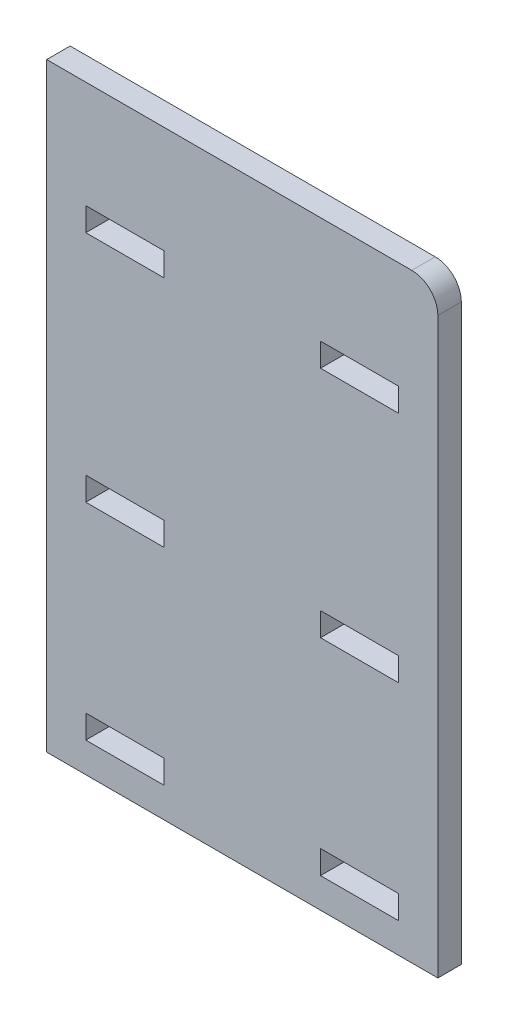
ISO-10303-21;
HEADER;
FILE_DESCRIPTION(('STEP AP214'),'2;1');
FILE_NAME('part.step','',(''),(''),'','','');
FILE_SCHEMA(('AUTOMOTIVE_DESIGN { 1 0 10303 214 1 1 1 1 }'));
ENDSEC;
DATA;
#1=APPLICATION_CONTEXT('core data for automotive mechanical design processes');
#2=APPLICATION_PROTOCOL_DEFINITION('international standard','automotive_design',2000,#1);
#3=PRODUCT_CONTEXT('',#1,'mechanical');
#4=PRODUCT('Part','Part','',(#3));
#5=PRODUCT_RELATED_PRODUCT_CATEGORY('part','',(#4));
#6=PRODUCT_DEFINITION_FORMATION('','',#4);
#7=PRODUCT_DEFINITION_CONTEXT('part definition',#1,'design');
#8=PRODUCT_DEFINITION('design','',#6,#7);
#9=PRODUCT_DEFINITION_SHAPE('','',#8);
#10=(LENGTH_UNIT() NAMED_UNIT(*) SI_UNIT(.MILLI.,.METRE.));
#11=(NAMED_UNIT(*) PLANE_ANGLE_UNIT() SI_UNIT($,.RADIAN.));
#12=(NAMED_UNIT(*) SI_UNIT($,.STERADIAN.) SOLID_ANGLE_UNIT());
#13=UNCERTAINTY_MEASURE_WITH_UNIT(LENGTH_MEASURE(1.E-05),#10,'distance_accuracy_value','');
#14=(GEOMETRIC_REPRESENTATION_CONTEXT(3) GLOBAL_UNCERTAINTY_ASSIGNED_CONTEXT((#13)) GLOBAL_UNIT_ASSIGNED_CONTEXT((#10,
#11,#12)) REPRESENTATION_CONTEXT('',''));
#15=CARTESIAN_POINT('',(0.,0.,0.));
#16=DIRECTION('',(0.,0.,1.));
#17=DIRECTION('',(1.,0.,0.));
#18=AXIS2_PLACEMENT_3D('',#15,#16,#17);
#19=CARTESIAN_POINT('',(0.,-47.25,4.5));
#20=DIRECTION('',(0.,-1.,0.));
#21=DIRECTION('',(0.,0.,-1.));
#22=AXIS2_PLACEMENT_3D('',#19,#20,#21);
#23=PLANE('',#22);
#24=DIRECTION('',(-1.,0.,0.));
#25=VECTOR('',#24,1.);
#26=CARTESIAN_POINT('',(0.,-47.25,0.));
#27=LINE('',#26,#25);
#28=CARTESIAN_POINT('',(30.,-47.25,0.));
#29=VERTEX_POINT('',#28);
#30=CARTESIAN_POINT('',(15.,-47.25,0.));
#31=VERTEX_POINT('',#30);
#32=EDGE_CURVE('E390',#29,#31,#27,.T.);
#33=ORIENTED_EDGE('',*,*,#32,.F.);
#34=DIRECTION('',(0.,0.,-1.));
#35=VECTOR('',#34,1.);
#36=CARTESIAN_POINT('',(30.,-47.25,4.5));
#37=LINE('',#36,#35);
#38=CARTESIAN_POINT('',(30.,-47.25,4.5));
#39=VERTEX_POINT('',#38);
#40=EDGE_CURVE('E406',#39,#29,#37,.T.);
#41=ORIENTED_EDGE('',*,*,#40,.F.);
#42=DIRECTION('',(-1.,0.,0.));
#43=VECTOR('',#42,1.);
#44=CARTESIAN_POINT('',(0.,-47.25,4.5));
#45=LINE('',#44,#43);
#46=CARTESIAN_POINT('',(15.,-47.25,4.5));
#47=VERTEX_POINT('',#46);
#48=EDGE_CURVE('E311',#39,#47,#45,.T.);
#49=ORIENTED_EDGE('',*,*,#48,.T.);
#50=DIRECTION('',(0.,0.,-1.));
#51=VECTOR('',#50,1.);
#52=CARTESIAN_POINT('',(15.,-47.25,4.5));
#53=LINE('',#52,#51);
#54=EDGE_CURVE('E398',#47,#31,#53,.T.);
#55=ORIENTED_EDGE('',*,*,#54,.T.);
#56=EDGE_LOOP('',(#33,#41,#49,#55));
#57=FACE_BOUND('',#56,.T.);
#58=ADVANCED_FACE('F34',(#57),#23,.T.);
#59=CARTESIAN_POINT('',(30.,0.,4.5));
#60=DIRECTION('',(1.,0.,0.));
#61=DIRECTION('',(0.,0.,-1.));
#62=AXIS2_PLACEMENT_3D('',#59,#60,#61);
#63=PLANE('',#62);
#64=DIRECTION('',(0.,-1.,0.));
#65=VECTOR('',#64,1.);
#66=CARTESIAN_POINT('',(30.,0.,0.));
#67=LINE('',#66,#65);
#68=CARTESIAN_POINT('',(30.,-51.75,0.));
#69=VERTEX_POINT('',#68);
#70=EDGE_CURVE('E393',#29,#69,#67,.T.);
#71=ORIENTED_EDGE('',*,*,#70,.T.);
#72=DIRECTION('',(0.,0.,-1.));
#73=VECTOR('',#72,1.);
#74=CARTESIAN_POINT('',(30.,-51.75,4.5));
#75=LINE('',#74,#73);
#76=CARTESIAN_POINT('',(30.,-51.75,4.5));
#77=VERTEX_POINT('',#76);
#78=EDGE_CURVE('E403',#77,#69,#75,.T.);
#79=ORIENTED_EDGE('',*,*,#78,.F.);
#80=DIRECTION('',(0.,-1.,0.));
#81=VECTOR('',#80,1.);
#82=CARTESIAN_POINT('',(30.,0.,4.5));
#83=LINE('',#82,#81);
#84=EDGE_CURVE('E314',#39,#77,#83,.T.);
#85=ORIENTED_EDGE('',*,*,#84,.F.);
#86=ORIENTED_EDGE('',*,*,#40,.T.);
#87=EDGE_LOOP('',(#71,#79,#85,#86));
#88=FACE_BOUND('',#87,.T.);
#89=ADVANCED_FACE('F480',(#88),#63,.F.);
#90=CARTESIAN_POINT('',(0.,-51.75,4.5));
#91=DIRECTION('',(0.,-1.,0.));
#92=DIRECTION('',(0.,0.,-1.));
#93=AXIS2_PLACEMENT_3D('',#90,#91,#92);
#94=PLANE('',#93);
#95=DIRECTION('',(-1.,0.,0.));
#96=VECTOR('',#95,1.);
#97=CARTESIAN_POINT('',(0.,-51.75,0.));
#98=LINE('',#97,#96);
#99=CARTESIAN_POINT('',(15.,-51.75,0.));
#100=VERTEX_POINT('',#99);
#101=EDGE_CURVE('E251',#69,#100,#98,.T.);
#102=ORIENTED_EDGE('',*,*,#101,.T.);
#103=DIRECTION('',(0.,0.,-1.));
#104=VECTOR('',#103,1.);
#105=CARTESIAN_POINT('',(15.,-51.75,4.5));
#106=LINE('',#105,#104);
#107=CARTESIAN_POINT('',(15.,-51.75,4.5));
#108=VERTEX_POINT('',#107);
#109=EDGE_CURVE('E400',#108,#100,#106,.T.);
#110=ORIENTED_EDGE('',*,*,#109,.F.);
#111=DIRECTION('',(-1.,0.,0.));
#112=VECTOR('',#111,1.);
#113=CARTESIAN_POINT('',(0.,-51.75,4.5));
#114=LINE('',#113,#112);
#115=EDGE_CURVE('E317',#77,#108,#114,.T.);
#116=ORIENTED_EDGE('',*,*,#115,.F.);
#117=ORIENTED_EDGE('',*,*,#78,.T.);
#118=EDGE_LOOP('',(#102,#110,#116,#117));
#119=FACE_BOUND('',#118,.T.);
#120=ADVANCED_FACE('F486',(#119),#94,.F.);
#121=CARTESIAN_POINT('',(0.,57.5,4.5));
#122=DIRECTION('',(0.,1.,0.));
#123=DIRECTION('',(0.,0.,1.));
#124=AXIS2_PLACEMENT_3D('',#121,#122,#123);
#125=PLANE('',#124);
#126=DIRECTION('',(1.,0.,0.));
#127=VECTOR('',#126,1.);
#128=CARTESIAN_POINT('',(0.,57.5,4.5));
#129=LINE('',#128,#127);
#130=CARTESIAN_POINT('',(-37.5,57.5,4.5));
#131=VERTEX_POINT('',#130);
#132=CARTESIAN_POINT('',(32.5,57.5,4.5));
#133=VERTEX_POINT('',#132);
#134=EDGE_CURVE('E300',#131,#133,#129,.T.);
#135=ORIENTED_EDGE('',*,*,#134,.T.);
#136=DIRECTION('',(0.,0.,-1.));
#137=VECTOR('',#136,1.);
#138=CARTESIAN_POINT('',(32.5,57.5,4.5));
#139=LINE('',#138,#137);
#140=CARTESIAN_POINT('',(32.5,57.5,0.));
#141=VERTEX_POINT('',#140);
#142=EDGE_CURVE('E408',#133,#141,#139,.T.);
#143=ORIENTED_EDGE('',*,*,#142,.T.);
#144=DIRECTION('',(1.,0.,0.));
#145=VECTOR('',#144,1.);
#146=CARTESIAN_POINT('',(0.,57.5,0.));
#147=LINE('',#146,#145);
#148=CARTESIAN_POINT('',(-37.5,57.5,0.));
#149=VERTEX_POINT('',#148);
#150=EDGE_CURVE('E380',#149,#141,#147,.T.);
#151=ORIENTED_EDGE('',*,*,#150,.F.);
#152=DIRECTION('',(0.,0.,-1.));
#153=VECTOR('',#152,1.);
#154=CARTESIAN_POINT('',(-37.5,57.5,4.5));
#155=LINE('',#154,#153);
#156=EDGE_CURVE('E401',#131,#149,#155,.T.);
#157=ORIENTED_EDGE('',*,*,#156,.F.);
#158=EDGE_LOOP('',(#135,#143,#151,#157));
#159=FACE_BOUND('',#158,.T.);
#160=ADVANCED_FACE('F460',(#159),#125,.T.);
#161=CARTESIAN_POINT('',(-37.5,0.,4.5));
#162=DIRECTION('',(1.,0.,0.));
#163=DIRECTION('',(0.,1.,0.));
#164=AXIS2_PLACEMENT_3D('',#161,#162,#163);
#165=PLANE('',#164);
#166=DIRECTION('',(0.,-1.,0.));
#167=VECTOR('',#166,1.);
#168=CARTESIAN_POINT('',(-37.5,0.,0.));
#169=LINE('',#168,#167);
#170=CARTESIAN_POINT('',(-37.5,-57.5,0.));
#171=VERTEX_POINT('',#170);
#172=EDGE_CURVE('E382',#149,#171,#169,.T.);
#173=ORIENTED_EDGE('',*,*,#172,.T.);
#174=DIRECTION('',(0.,0.,-1.));
#175=VECTOR('',#174,1.);
#176=CARTESIAN_POINT('',(-37.5,-57.5,4.5));
#177=LINE('',#176,#175);
#178=CARTESIAN_POINT('',(-37.5,-57.5,4.5));
#179=VERTEX_POINT('',#178);
#180=EDGE_CURVE('E412',#179,#171,#177,.T.);
#181=ORIENTED_EDGE('',*,*,#180,.F.);
#182=DIRECTION('',(0.,-1.,0.));
#183=VECTOR('',#182,1.);
#184=CARTESIAN_POINT('',(-37.5,0.,4.5));
#185=LINE('',#184,#183);
#186=EDGE_CURVE('E303',#131,#179,#185,.T.);
#187=ORIENTED_EDGE('',*,*,#186,.F.);
#188=ORIENTED_EDGE('',*,*,#156,.T.);
#189=EDGE_LOOP('',(#173,#181,#187,#188));
#190=FACE_BOUND('',#189,.T.);
#191=ADVANCED_FACE('F469',(#190),#165,.F.);
#192=CARTESIAN_POINT('',(0.,-57.5,4.5));
#193=DIRECTION('',(0.,1.,0.));
#194=DIRECTION('',(0.,0.,1.));
#195=AXIS2_PLACEMENT_3D('',#192,#193,#194);
#196=PLANE('',#195);
#197=DIRECTION('',(1.,0.,0.));
#198=VECTOR('',#197,1.);
#199=CARTESIAN_POINT('',(0.,-57.5,0.));
#200=LINE('',#199,#198);
#201=CARTESIAN_POINT('',(37.5,-57.5,0.));
#202=VERTEX_POINT('',#201);
#203=EDGE_CURVE('E385',#171,#202,#200,.T.);
#204=ORIENTED_EDGE('',*,*,#203,.T.);
#205=DIRECTION('',(0.,0.,-1.));
#206=VECTOR('',#205,1.);
#207=CARTESIAN_POINT('',(37.5,-57.5,4.5));
#208=LINE('',#207,#206);
#209=CARTESIAN_POINT('',(37.5,-57.5,4.5));
#210=VERTEX_POINT('',#209);
#211=EDGE_CURVE('E409',#210,#202,#208,.T.);
#212=ORIENTED_EDGE('',*,*,#211,.F.);
#213=DIRECTION('',(1.,0.,0.));
#214=VECTOR('',#213,1.);
#215=CARTESIAN_POINT('',(0.,-57.5,4.5));
#216=LINE('',#215,#214);
#217=EDGE_CURVE('E306',#179,#210,#216,.T.);
#218=ORIENTED_EDGE('',*,*,#217,.F.);
#219=ORIENTED_EDGE('',*,*,#180,.T.);
#220=EDGE_LOOP('',(#204,#212,#218,#219));
#221=FACE_BOUND('',#220,.T.);
#222=ADVANCED_FACE('F497',(#221),#196,.F.);
#223=CARTESIAN_POINT('',(0.,37.,4.5));
#224=DIRECTION('',(0.,1.,0.));
#225=DIRECTION('',(0.,0.,1.));
#226=AXIS2_PLACEMENT_3D('',#223,#224,#225);
#227=PLANE('',#226);
#228=DIRECTION('',(1.,0.,0.));
#229=VECTOR('',#228,1.);
#230=CARTESIAN_POINT('',(0.,37.,0.));
#231=LINE('',#230,#229);
#232=CARTESIAN_POINT('',(-30.,37.,0.));
#233=VERTEX_POINT('',#232);
#234=CARTESIAN_POINT('',(-15.,37.,0.));
#235=VERTEX_POINT('',#234);
#236=EDGE_CURVE('E368',#233,#235,#231,.T.);
#237=ORIENTED_EDGE('',*,*,#236,.T.);
#238=DIRECTION('',(0.,0.,-1.));
#239=VECTOR('',#238,1.);
#240=CARTESIAN_POINT('',(-15.,37.,4.5));
#241=LINE('',#240,#239);
#242=CARTESIAN_POINT('',(-15.,37.,4.5));
#243=VERTEX_POINT('',#242);
#244=EDGE_CURVE('E413',#243,#235,#241,.T.);
#245=ORIENTED_EDGE('',*,*,#244,.F.);
#246=DIRECTION('',(1.,0.,0.));
#247=VECTOR('',#246,1.);
#248=CARTESIAN_POINT('',(0.,37.,4.5));
#249=LINE('',#248,#247);
#250=CARTESIAN_POINT('',(-30.,37.,4.5));
#251=VERTEX_POINT('',#250);
#252=EDGE_CURVE('E289',#251,#243,#249,.T.);
#253=ORIENTED_EDGE('',*,*,#252,.F.);
#254=DIRECTION('',(0.,0.,-1.));
#255=VECTOR('',#254,1.);
#256=CARTESIAN_POINT('',(-30.,37.,4.5));
#257=LINE('',#256,#255);
#258=EDGE_CURVE('E417',#251,#233,#257,.T.);
#259=ORIENTED_EDGE('',*,*,#258,.T.);
#260=EDGE_LOOP('',(#237,#245,#253,#259));
#261=FACE_BOUND('',#260,.T.);
#262=ADVANCED_FACE('F500',(#261),#227,.F.);
#263=CARTESIAN_POINT('',(-15.,0.,4.5));
#264=DIRECTION('',(1.,0.,0.));
#265=DIRECTION('',(0.,1.,0.));
#266=AXIS2_PLACEMENT_3D('',#263,#264,#265);
#267=PLANE('',#266);
#268=DIRECTION('',(0.,-1.,0.));
#269=VECTOR('',#268,1.);
#270=CARTESIAN_POINT('',(-15.,0.,0.));
#271=LINE('',#270,#269);
#272=CARTESIAN_POINT('',(-15.,32.5,0.));
#273=VERTEX_POINT('',#272);
#274=EDGE_CURVE('E371',#235,#273,#271,.T.);
#275=ORIENTED_EDGE('',*,*,#274,.T.);
#276=DIRECTION('',(0.,0.,-1.));
#277=VECTOR('',#276,1.);
#278=CARTESIAN_POINT('',(-15.,32.5,4.5));
#279=LINE('',#278,#277);
#280=CARTESIAN_POINT('',(-15.,32.5,4.5));
#281=VERTEX_POINT('',#280);
#282=EDGE_CURVE('E422',#281,#273,#279,.T.);
#283=ORIENTED_EDGE('',*,*,#282,.F.);
#284=DIRECTION('',(0.,-1.,0.));
#285=VECTOR('',#284,1.);
#286=CARTESIAN_POINT('',(-15.,0.,4.5));
#287=LINE('',#286,#285);
#288=EDGE_CURVE('E292',#243,#281,#287,.T.);
#289=ORIENTED_EDGE('',*,*,#288,.F.);
#290=ORIENTED_EDGE('',*,*,#244,.T.);
#291=EDGE_LOOP('',(#275,#283,#289,#290));
#292=FACE_BOUND('',#291,.T.);
#293=ADVANCED_FACE('F514',(#292),#267,.F.);
#294=CARTESIAN_POINT('',(0.,32.5,4.5));
#295=DIRECTION('',(0.,1.,0.));
#296=DIRECTION('',(0.,0.,1.));
#297=AXIS2_PLACEMENT_3D('',#294,#295,#296);
#298=PLANE('',#297);
#299=DIRECTION('',(1.,0.,0.));
#300=VECTOR('',#299,1.);
#301=CARTESIAN_POINT('',(0.,32.5,0.));
#302=LINE('',#301,#300);
#303=CARTESIAN_POINT('',(-30.,32.5,0.));
#304=VERTEX_POINT('',#303);
#305=EDGE_CURVE('E374',#304,#273,#302,.T.);
#306=ORIENTED_EDGE('',*,*,#305,.F.);
#307=DIRECTION('',(0.,0.,-1.));
#308=VECTOR('',#307,1.);
#309=CARTESIAN_POINT('',(-30.,32.5,4.5));
#310=LINE('',#309,#308);
#311=CARTESIAN_POINT('',(-30.,32.5,4.5));
#312=VERTEX_POINT('',#311);
#313=EDGE_CURVE('E419',#312,#304,#310,.T.);
#314=ORIENTED_EDGE('',*,*,#313,.F.);
#315=DIRECTION('',(1.,0.,0.));
#316=VECTOR('',#315,1.);
#317=CARTESIAN_POINT('',(0.,32.5,4.5));
#318=LINE('',#317,#316);
#319=EDGE_CURVE('E294',#312,#281,#318,.T.);
#320=ORIENTED_EDGE('',*,*,#319,.T.);
#321=ORIENTED_EDGE('',*,*,#282,.T.);
#322=EDGE_LOOP('',(#306,#314,#320,#321));
#323=FACE_BOUND('',#322,.T.);
#324=ADVANCED_FACE('F510',(#323),#298,.T.);
#325=CARTESIAN_POINT('',(0.,37.,4.5));
#326=DIRECTION('',(0.,-1.,0.));
#327=DIRECTION('',(0.,0.,-1.));
#328=AXIS2_PLACEMENT_3D('',#325,#326,#327);
#329=PLANE('',#328);
#330=DIRECTION('',(-1.,0.,0.));
#331=VECTOR('',#330,1.);
#332=CARTESIAN_POINT('',(0.,37.,0.));
#333=LINE('',#332,#331);
#334=CARTESIAN_POINT('',(30.0000000000001,37.,0.));
#335=VERTEX_POINT('',#334);
#336=CARTESIAN_POINT('',(15.0000000000001,37.,0.));
#337=VERTEX_POINT('',#336);
#338=EDGE_CURVE('E356',#335,#337,#333,.T.);
#339=ORIENTED_EDGE('',*,*,#338,.F.);
#340=DIRECTION('',(0.,0.,-1.));
#341=VECTOR('',#340,1.);
#342=CARTESIAN_POINT('',(30.0000000000001,37.,4.5));
#343=LINE('',#342,#341);
#344=CARTESIAN_POINT('',(30.0000000000001,37.,4.5));
#345=VERTEX_POINT('',#344);
#346=EDGE_CURVE('E420',#345,#335,#343,.T.);
#347=ORIENTED_EDGE('',*,*,#346,.F.);
#348=DIRECTION('',(-1.,0.,0.));
#349=VECTOR('',#348,1.);
#350=CARTESIAN_POINT('',(0.,37.,4.5));
#351=LINE('',#350,#349);
#352=CARTESIAN_POINT('',(15.0000000000001,37.,4.5));
#353=VERTEX_POINT('',#352);
#354=EDGE_CURVE('E278',#345,#353,#351,.T.);
#355=ORIENTED_EDGE('',*,*,#354,.T.);
#356=DIRECTION('',(0.,0.,-1.));
#357=VECTOR('',#356,1.);
#358=CARTESIAN_POINT('',(15.0000000000001,37.,4.5));
#359=LINE('',#358,#357);
#360=EDGE_CURVE('E426',#353,#337,#359,.T.);
#361=ORIENTED_EDGE('',*,*,#360,.T.);
#362=EDGE_LOOP('',(#339,#347,#355,#361));
#363=FACE_BOUND('',#362,.T.);
#364=ADVANCED_FACE('F513',(#363),#329,.T.);
#365=CARTESIAN_POINT('',(30.0000000000001,0.,4.5));
#366=DIRECTION('',(1.,0.,0.));
#367=DIRECTION('',(0.,0.,-1.));
#368=AXIS2_PLACEMENT_3D('',#365,#366,#367);
#369=PLANE('',#368);
#370=DIRECTION('',(0.,-1.,0.));
#371=VECTOR('',#370,1.);
#372=CARTESIAN_POINT('',(30.0000000000001,0.,0.));
#373=LINE('',#372,#371);
#374=CARTESIAN_POINT('',(30.0000000000001,32.5,0.));
#375=VERTEX_POINT('',#374);
#376=EDGE_CURVE('E359',#335,#375,#373,.T.);
#377=ORIENTED_EDGE('',*,*,#376,.T.);
#378=DIRECTION('',(0.,0.,-1.));
#379=VECTOR('',#378,1.);
#380=CARTESIAN_POINT('',(30.0000000000001,32.5,4.5));
#381=LINE('',#380,#379);
#382=CARTESIAN_POINT('',(30.0000000000001,32.5,4.5));
#383=VERTEX_POINT('',#382);
#384=EDGE_CURVE('E431',#383,#375,#381,.T.);
#385=ORIENTED_EDGE('',*,*,#384,.F.);
#386=DIRECTION('',(0.,-1.,0.));
#387=VECTOR('',#386,1.);
#388=CARTESIAN_POINT('',(30.0000000000001,0.,4.5));
#389=LINE('',#388,#387);
#390=EDGE_CURVE('E281',#345,#383,#389,.T.);
#391=ORIENTED_EDGE('',*,*,#390,.F.);
#392=ORIENTED_EDGE('',*,*,#346,.T.);
#393=EDGE_LOOP('',(#377,#385,#391,#392));
#394=FACE_BOUND('',#393,.T.);
#395=ADVANCED_FACE('F530',(#394),#369,.F.);
#396=CARTESIAN_POINT('',(0.,32.5,4.5));
#397=DIRECTION('',(0.,-1.,0.));
#398=DIRECTION('',(0.,0.,-1.));
#399=AXIS2_PLACEMENT_3D('',#396,#397,#398);
#400=PLANE('',#399);
#401=DIRECTION('',(-1.,0.,0.));
#402=VECTOR('',#401,1.);
#403=CARTESIAN_POINT('',(0.,32.5,0.));
#404=LINE('',#403,#402);
#405=CARTESIAN_POINT('',(15.0000000000001,32.5,0.));
#406=VERTEX_POINT('',#405);
#407=EDGE_CURVE('E362',#375,#406,#404,.T.);
#408=ORIENTED_EDGE('',*,*,#407,.T.);
#409=DIRECTION('',(0.,0.,-1.));
#410=VECTOR('',#409,1.);
#411=CARTESIAN_POINT('',(15.0000000000001,32.5,4.5));
#412=LINE('',#411,#410);
#413=CARTESIAN_POINT('',(15.0000000000001,32.5,4.5));
#414=VERTEX_POINT('',#413);
#415=EDGE_CURVE('E428',#414,#406,#412,.T.);
#416=ORIENTED_EDGE('',*,*,#415,.F.);
#417=DIRECTION('',(-1.,0.,0.));
#418=VECTOR('',#417,1.);
#419=CARTESIAN_POINT('',(0.,32.5,4.5));
#420=LINE('',#419,#418);
#421=EDGE_CURVE('E284',#383,#414,#420,.T.);
#422=ORIENTED_EDGE('',*,*,#421,.F.);
#423=ORIENTED_EDGE('',*,*,#384,.T.);
#424=EDGE_LOOP('',(#408,#416,#422,#423));
#425=FACE_BOUND('',#424,.T.);
#426=ADVANCED_FACE('F526',(#425),#400,.F.);
#427=CARTESIAN_POINT('',(0.,-7.75,4.5));
#428=DIRECTION('',(0.,-1.,0.));
#429=DIRECTION('',(1.,0.,0.));
#430=AXIS2_PLACEMENT_3D('',#427,#428,#429);
#431=PLANE('',#430);
#432=DIRECTION('',(-1.,0.,0.));
#433=VECTOR('',#432,1.);
#434=CARTESIAN_POINT('',(0.,-7.75,0.));
#435=LINE('',#434,#433);
#436=CARTESIAN_POINT('',(30.,-7.75,0.));
#437=VERTEX_POINT('',#436);
#438=CARTESIAN_POINT('',(15.,-7.75,0.));
#439=VERTEX_POINT('',#438);
#440=EDGE_CURVE('E344',#437,#439,#435,.T.);
#441=ORIENTED_EDGE('',*,*,#440,.F.);
#442=DIRECTION('',(0.,0.,-1.));
#443=VECTOR('',#442,1.);
#444=CARTESIAN_POINT('',(30.,-7.75,4.5));
#445=LINE('',#444,#443);
#446=CARTESIAN_POINT('',(30.,-7.75,4.5));
#447=VERTEX_POINT('',#446);
#448=EDGE_CURVE('E429',#447,#437,#445,.T.);
#449=ORIENTED_EDGE('',*,*,#448,.F.);
#450=DIRECTION('',(-1.,0.,0.));
#451=VECTOR('',#450,1.);
#452=CARTESIAN_POINT('',(0.,-7.75,4.5));
#453=LINE('',#452,#451);
#454=CARTESIAN_POINT('',(15.,-7.75,4.5));
#455=VERTEX_POINT('',#454);
#456=EDGE_CURVE('E267',#447,#455,#453,.T.);
#457=ORIENTED_EDGE('',*,*,#456,.T.);
#458=DIRECTION('',(0.,0.,-1.));
#459=VECTOR('',#458,1.);
#460=CARTESIAN_POINT('',(15.,-7.75,4.5));
#461=LINE('',#460,#459);
#462=EDGE_CURVE('E435',#455,#439,#461,.T.);
#463=ORIENTED_EDGE('',*,*,#462,.T.);
#464=EDGE_LOOP('',(#441,#449,#457,#463));
#465=FACE_BOUND('',#464,.T.);
#466=ADVANCED_FACE('F529',(#465),#431,.T.);
#467=CARTESIAN_POINT('',(30.,0.,4.5));
#468=DIRECTION('',(1.,0.,0.));
#469=DIRECTION('',(0.,0.,-1.));
#470=AXIS2_PLACEMENT_3D('',#467,#468,#469);
#471=PLANE('',#470);
#472=DIRECTION('',(0.,-1.,0.));
#473=VECTOR('',#472,1.);
#474=CARTESIAN_POINT('',(30.,0.,0.));
#475=LINE('',#474,#473);
#476=CARTESIAN_POINT('',(30.,-12.25,0.));
#477=VERTEX_POINT('',#476);
#478=EDGE_CURVE('E347',#437,#477,#475,.T.);
#479=ORIENTED_EDGE('',*,*,#478,.T.);
#480=DIRECTION('',(0.,0.,-1.));
#481=VECTOR('',#480,1.);
#482=CARTESIAN_POINT('',(30.,-12.25,4.5));
#483=LINE('',#482,#481);
#484=CARTESIAN_POINT('',(30.,-12.25,4.5));
#485=VERTEX_POINT('',#484);
#486=EDGE_CURVE('E440',#485,#477,#483,.T.);
#487=ORIENTED_EDGE('',*,*,#486,.F.);
#488=DIRECTION('',(0.,-1.,0.));
#489=VECTOR('',#488,1.);
#490=CARTESIAN_POINT('',(30.,0.,4.5));
#491=LINE('',#490,#489);
#492=EDGE_CURVE('E270',#447,#485,#491,.T.);
#493=ORIENTED_EDGE('',*,*,#492,.F.);
#494=ORIENTED_EDGE('',*,*,#448,.T.);
#495=EDGE_LOOP('',(#479,#487,#493,#494));
#496=FACE_BOUND('',#495,.T.);
#497=ADVANCED_FACE('F546',(#496),#471,.F.);
#498=CARTESIAN_POINT('',(0.,-12.25,4.5));
#499=DIRECTION('',(0.,-1.,0.));
#500=DIRECTION('',(1.,0.,0.));
#501=AXIS2_PLACEMENT_3D('',#498,#499,#500);
#502=PLANE('',#501);
#503=DIRECTION('',(-1.,0.,0.));
#504=VECTOR('',#503,1.);
#505=CARTESIAN_POINT('',(0.,-12.25,0.));
#506=LINE('',#505,#504);
#507=CARTESIAN_POINT('',(15.,-12.25,0.));
#508=VERTEX_POINT('',#507);
#509=EDGE_CURVE('E350',#477,#508,#506,.T.);
#510=ORIENTED_EDGE('',*,*,#509,.T.);
#511=DIRECTION('',(0.,0.,-1.));
#512=VECTOR('',#511,1.);
#513=CARTESIAN_POINT('',(15.,-12.25,4.5));
#514=LINE('',#513,#512);
#515=CARTESIAN_POINT('',(15.,-12.25,4.5));
#516=VERTEX_POINT('',#515);
#517=EDGE_CURVE('E437',#516,#508,#514,.T.);
#518=ORIENTED_EDGE('',*,*,#517,.F.);
#519=DIRECTION('',(-1.,0.,0.));
#520=VECTOR('',#519,1.);
#521=CARTESIAN_POINT('',(0.,-12.25,4.5));
#522=LINE('',#521,#520);
#523=EDGE_CURVE('E273',#485,#516,#522,.T.);
#524=ORIENTED_EDGE('',*,*,#523,.F.);
#525=ORIENTED_EDGE('',*,*,#486,.T.);
#526=EDGE_LOOP('',(#510,#518,#524,#525));
#527=FACE_BOUND('',#526,.T.);
#528=ADVANCED_FACE('F542',(#527),#502,.F.);
#529=CARTESIAN_POINT('',(0.,-12.25,4.5));
#530=DIRECTION('',(0.,1.,0.));
#531=DIRECTION('',(0.,0.,1.));
#532=AXIS2_PLACEMENT_3D('',#529,#530,#531);
#533=PLANE('',#532);
#534=DIRECTION('',(1.,0.,0.));
#535=VECTOR('',#534,1.);
#536=CARTESIAN_POINT('',(0.,-12.25,0.));
#537=LINE('',#536,#535);
#538=CARTESIAN_POINT('',(-30.,-12.25,0.));
#539=VERTEX_POINT('',#538);
#540=CARTESIAN_POINT('',(-15.,-12.25,0.));
#541=VERTEX_POINT('',#540);
#542=EDGE_CURVE('E332',#539,#541,#537,.T.);
#543=ORIENTED_EDGE('',*,*,#542,.F.);
#544=DIRECTION('',(0.,0.,-1.));
#545=VECTOR('',#544,1.);
#546=CARTESIAN_POINT('',(-30.,-12.25,4.5));
#547=LINE('',#546,#545);
#548=CARTESIAN_POINT('',(-30.,-12.25,4.5));
#549=VERTEX_POINT('',#548);
#550=EDGE_CURVE('E438',#549,#539,#547,.T.);
#551=ORIENTED_EDGE('',*,*,#550,.F.);
#552=DIRECTION('',(1.,0.,0.));
#553=VECTOR('',#552,1.);
#554=CARTESIAN_POINT('',(0.,-12.25,4.5));
#555=LINE('',#554,#553);
#556=CARTESIAN_POINT('',(-15.,-12.25,4.5));
#557=VERTEX_POINT('',#556);
#558=EDGE_CURVE('E256',#549,#557,#555,.T.);
#559=ORIENTED_EDGE('',*,*,#558,.T.);
#560=DIRECTION('',(0.,0.,-1.));
#561=VECTOR('',#560,1.);
#562=CARTESIAN_POINT('',(-15.,-12.25,4.5));
#563=LINE('',#562,#561);
#564=EDGE_CURVE('E233',#557,#541,#563,.T.);
#565=ORIENTED_EDGE('',*,*,#564,.T.);
#566=EDGE_LOOP('',(#543,#551,#559,#565));
#567=FACE_BOUND('',#566,.T.);
#568=ADVANCED_FACE('F545',(#567),#533,.T.);
#569=CARTESIAN_POINT('',(-30.,0.,4.5));
#570=DIRECTION('',(1.,0.,0.));
#571=DIRECTION('',(0.,0.,-1.));
#572=AXIS2_PLACEMENT_3D('',#569,#570,#571);
#573=PLANE('',#572);
#574=DIRECTION('',(0.,-1.,0.));
#575=VECTOR('',#574,1.);
#576=CARTESIAN_POINT('',(-30.,0.,0.));
#577=LINE('',#576,#575);
#578=CARTESIAN_POINT('',(-30.,-7.75,0.));
#579=VERTEX_POINT('',#578);
#580=EDGE_CURVE('E335',#579,#539,#577,.T.);
#581=ORIENTED_EDGE('',*,*,#580,.F.);
#582=DIRECTION('',(0.,0.,-1.));
#583=VECTOR('',#582,1.);
#584=CARTESIAN_POINT('',(-30.,-7.75,4.5));
#585=LINE('',#584,#583);
#586=CARTESIAN_POINT('',(-30.,-7.75,4.5));
#587=VERTEX_POINT('',#586);
#588=EDGE_CURVE('E448',#587,#579,#585,.T.);
#589=ORIENTED_EDGE('',*,*,#588,.F.);
#590=DIRECTION('',(0.,-1.,0.));
#591=VECTOR('',#590,1.);
#592=CARTESIAN_POINT('',(-30.,0.,4.5));
#593=LINE('',#592,#591);
#594=EDGE_CURVE('E259',#587,#549,#593,.T.);
#595=ORIENTED_EDGE('',*,*,#594,.T.);
#596=ORIENTED_EDGE('',*,*,#550,.T.);
#597=EDGE_LOOP('',(#581,#589,#595,#596));
#598=FACE_BOUND('',#597,.T.);
#599=ADVANCED_FACE('F561',(#598),#573,.T.);
#600=CARTESIAN_POINT('',(0.,-7.75,4.5));
#601=DIRECTION('',(0.,1.,0.));
#602=DIRECTION('',(0.,0.,1.));
#603=AXIS2_PLACEMENT_3D('',#600,#601,#602);
#604=PLANE('',#603);
#605=DIRECTION('',(1.,0.,0.));
#606=VECTOR('',#605,1.);
#607=CARTESIAN_POINT('',(0.,-7.75,0.));
#608=LINE('',#607,#606);
#609=CARTESIAN_POINT('',(-15.,-7.75,0.));
#610=VERTEX_POINT('',#609);
#611=EDGE_CURVE('E338',#579,#610,#608,.T.);
#612=ORIENTED_EDGE('',*,*,#611,.T.);
#613=DIRECTION('',(0.,0.,-1.));
#614=VECTOR('',#613,1.);
#615=CARTESIAN_POINT('',(-15.,-7.75,4.5));
#616=LINE('',#615,#614);
#617=CARTESIAN_POINT('',(-15.,-7.75,4.5));
#618=VERTEX_POINT('',#617);
#619=EDGE_CURVE('E445',#618,#610,#616,.T.);
#620=ORIENTED_EDGE('',*,*,#619,.F.);
#621=DIRECTION('',(1.,0.,0.));
#622=VECTOR('',#621,1.);
#623=CARTESIAN_POINT('',(0.,-7.75,4.5));
#624=LINE('',#623,#622);
#625=EDGE_CURVE('E262',#587,#618,#624,.T.);
#626=ORIENTED_EDGE('',*,*,#625,.F.);
#627=ORIENTED_EDGE('',*,*,#588,.T.);
#628=EDGE_LOOP('',(#612,#620,#626,#627));
#629=FACE_BOUND('',#628,.T.);
#630=ADVANCED_FACE('F558',(#629),#604,.F.);
#631=CARTESIAN_POINT('',(-30.,0.,4.5));
#632=DIRECTION('',(1.,0.,0.));
#633=DIRECTION('',(0.,0.,-1.));
#634=AXIS2_PLACEMENT_3D('',#631,#632,#633);
#635=PLANE('',#634);
#636=DIRECTION('',(0.,-1.,0.));
#637=VECTOR('',#636,1.);
#638=CARTESIAN_POINT('',(-30.,0.,0.));
#639=LINE('',#638,#637);
#640=CARTESIAN_POINT('',(-30.,-47.25,0.));
#641=VERTEX_POINT('',#640);
#642=CARTESIAN_POINT('',(-30.,-51.75,0.));
#643=VERTEX_POINT('',#642);
#644=EDGE_CURVE('E230',#641,#643,#639,.T.);
#645=ORIENTED_EDGE('',*,*,#644,.F.);
#646=DIRECTION('',(0.,0.,-1.));
#647=VECTOR('',#646,1.);
#648=CARTESIAN_POINT('',(-30.,-47.25,4.5));
#649=LINE('',#648,#647);
#650=CARTESIAN_POINT('',(-30.,-47.25,4.5));
#651=VERTEX_POINT('',#650);
#652=EDGE_CURVE('E223',#651,#641,#649,.T.);
#653=ORIENTED_EDGE('',*,*,#652,.F.);
#654=DIRECTION('',(0.,-1.,0.));
#655=VECTOR('',#654,1.);
#656=CARTESIAN_POINT('',(-30.,0.,4.5));
#657=LINE('',#656,#655);
#658=CARTESIAN_POINT('',(-30.,-51.75,4.5));
#659=VERTEX_POINT('',#658);
#660=EDGE_CURVE('E227',#651,#659,#657,.T.);
#661=ORIENTED_EDGE('',*,*,#660,.T.);
#662=DIRECTION('',(0.,0.,-1.));
#663=VECTOR('',#662,1.);
#664=CARTESIAN_POINT('',(-30.,-51.75,4.5));
#665=LINE('',#664,#663);
#666=EDGE_CURVE('E322',#659,#643,#665,.T.);
#667=ORIENTED_EDGE('',*,*,#666,.T.);
#668=EDGE_LOOP('',(#645,#653,#661,#667));
#669=FACE_BOUND('',#668,.T.);
#670=ADVANCED_FACE('F225',(#669),#635,.T.);
#671=CARTESIAN_POINT('',(0.,-47.25,4.5));
#672=DIRECTION('',(0.,1.,0.));
#673=DIRECTION('',(0.,0.,1.));
#674=AXIS2_PLACEMENT_3D('',#671,#672,#673);
#675=PLANE('',#674);
#676=DIRECTION('',(1.,0.,0.));
#677=VECTOR('',#676,1.);
#678=CARTESIAN_POINT('',(0.,-47.25,0.));
#679=LINE('',#678,#677);
#680=CARTESIAN_POINT('',(-15.,-47.25,0.));
#681=VERTEX_POINT('',#680);
#682=EDGE_CURVE('E324',#641,#681,#679,.T.);
#683=ORIENTED_EDGE('',*,*,#682,.T.);
#684=DIRECTION('',(0.,0.,-1.));
#685=VECTOR('',#684,1.);
#686=CARTESIAN_POINT('',(-15.,-47.25,4.5));
#687=LINE('',#686,#685);
#688=CARTESIAN_POINT('',(-15.,-47.25,4.5));
#689=VERTEX_POINT('',#688);
#690=EDGE_CURVE('E234',#689,#681,#687,.T.);
#691=ORIENTED_EDGE('',*,*,#690,.F.);
#692=DIRECTION('',(1.,0.,0.));
#693=VECTOR('',#692,1.);
#694=CARTESIAN_POINT('',(0.,-47.25,4.5));
#695=LINE('',#694,#693);
#696=EDGE_CURVE('E237',#651,#689,#695,.T.);
#697=ORIENTED_EDGE('',*,*,#696,.F.);
#698=ORIENTED_EDGE('',*,*,#652,.T.);
#699=EDGE_LOOP('',(#683,#691,#697,#698));
#700=FACE_BOUND('',#699,.T.);
#701=ADVANCED_FACE('F238',(#700),#675,.F.);
#702=CARTESIAN_POINT('',(-15.,0.,4.5));
#703=DIRECTION('',(1.,0.,0.));
#704=DIRECTION('',(0.,0.,-1.));
#705=AXIS2_PLACEMENT_3D('',#702,#703,#704);
#706=PLANE('',#705);
#707=DIRECTION('',(0.,-1.,0.));
#708=VECTOR('',#707,1.);
#709=CARTESIAN_POINT('',(-15.,0.,0.));
#710=LINE('',#709,#708);
#711=CARTESIAN_POINT('',(-15.,-51.75,0.));
#712=VERTEX_POINT('',#711);
#713=EDGE_CURVE('E326',#681,#712,#710,.T.);
#714=ORIENTED_EDGE('',*,*,#713,.T.);
#715=DIRECTION('',(0.,0.,-1.));
#716=VECTOR('',#715,1.);
#717=CARTESIAN_POINT('',(-15.,-51.75,4.5));
#718=LINE('',#717,#716);
#719=CARTESIAN_POINT('',(-15.,-51.75,4.5));
#720=VERTEX_POINT('',#719);
#721=EDGE_CURVE('E452',#720,#712,#718,.T.);
#722=ORIENTED_EDGE('',*,*,#721,.F.);
#723=DIRECTION('',(0.,-1.,0.));
#724=VECTOR('',#723,1.);
#725=CARTESIAN_POINT('',(-15.,0.,4.5));
#726=LINE('',#725,#724);
#727=EDGE_CURVE('E242',#689,#720,#726,.T.);
#728=ORIENTED_EDGE('',*,*,#727,.F.);
#729=ORIENTED_EDGE('',*,*,#690,.T.);
#730=EDGE_LOOP('',(#714,#722,#728,#729));
#731=FACE_BOUND('',#730,.T.);
#732=ADVANCED_FACE('F496',(#731),#706,.F.);
#733=CARTESIAN_POINT('',(37.5,0.,4.5));
#734=DIRECTION('',(1.,0.,0.));
#735=DIRECTION('',(0.,1.,0.));
#736=AXIS2_PLACEMENT_3D('',#733,#734,#735);
#737=PLANE('',#736);
#738=DIRECTION('',(0.,-1.,0.));
#739=VECTOR('',#738,1.);
#740=CARTESIAN_POINT('',(37.5,0.,0.));
#741=LINE('',#740,#739);
#742=CARTESIAN_POINT('',(37.5,52.5,0.));
#743=VERTEX_POINT('',#742);
#744=EDGE_CURVE('E388',#743,#202,#741,.T.);
#745=ORIENTED_EDGE('',*,*,#744,.F.);
#746=DIRECTION('',(0.,0.,-1.));
#747=VECTOR('',#746,1.);
#748=CARTESIAN_POINT('',(37.5,52.5,4.5));
#749=LINE('',#748,#747);
#750=CARTESIAN_POINT('',(37.5,52.5,4.5));
#751=VERTEX_POINT('',#750);
#752=EDGE_CURVE('E42',#743,#751,#749,.F.);
#753=ORIENTED_EDGE('',*,*,#752,.T.);
#754=DIRECTION('',(0.,-1.,0.));
#755=VECTOR('',#754,1.);
#756=CARTESIAN_POINT('',(37.5,0.,4.5));
#757=LINE('',#756,#755);
#758=EDGE_CURVE('E309',#751,#210,#757,.T.);
#759=ORIENTED_EDGE('',*,*,#758,.T.);
#760=ORIENTED_EDGE('',*,*,#211,.T.);
#761=EDGE_LOOP('',(#745,#753,#759,#760));
#762=FACE_BOUND('',#761,.T.);
#763=ADVANCED_FACE('F492',(#762),#737,.T.);
#764=CARTESIAN_POINT('',(-30.,0.,4.5));
#765=DIRECTION('',(1.,0.,0.));
#766=DIRECTION('',(0.,0.,-1.));
#767=AXIS2_PLACEMENT_3D('',#764,#765,#766);
#768=PLANE('',#767);
#769=DIRECTION('',(0.,-1.,0.));
#770=VECTOR('',#769,1.);
#771=CARTESIAN_POINT('',(-30.,0.,0.));
#772=LINE('',#771,#770);
#773=EDGE_CURVE('E377',#233,#304,#772,.T.);
#774=ORIENTED_EDGE('',*,*,#773,.F.);
#775=ORIENTED_EDGE('',*,*,#258,.F.);
#776=DIRECTION('',(0.,-1.,0.));
#777=VECTOR('',#776,1.);
#778=CARTESIAN_POINT('',(-30.,0.,4.5));
#779=LINE('',#778,#777);
#780=EDGE_CURVE('E297',#251,#312,#779,.T.);
#781=ORIENTED_EDGE('',*,*,#780,.T.);
#782=ORIENTED_EDGE('',*,*,#313,.T.);
#783=EDGE_LOOP('',(#774,#775,#781,#782));
#784=FACE_BOUND('',#783,.T.);
#785=ADVANCED_FACE('F495',(#784),#768,.T.);
#786=CARTESIAN_POINT('',(15.0000000000001,0.,4.5));
#787=DIRECTION('',(1.,0.,0.));
#788=DIRECTION('',(0.,1.,0.));
#789=AXIS2_PLACEMENT_3D('',#786,#787,#788);
#790=PLANE('',#789);
#791=DIRECTION('',(0.,-1.,0.));
#792=VECTOR('',#791,1.);
#793=CARTESIAN_POINT('',(15.0000000000001,0.,0.));
#794=LINE('',#793,#792);
#795=EDGE_CURVE('E365',#337,#406,#794,.T.);
#796=ORIENTED_EDGE('',*,*,#795,.F.);
#797=ORIENTED_EDGE('',*,*,#360,.F.);
#798=DIRECTION('',(0.,-1.,0.));
#799=VECTOR('',#798,1.);
#800=CARTESIAN_POINT('',(15.0000000000001,0.,4.5));
#801=LINE('',#800,#799);
#802=EDGE_CURVE('E286',#353,#414,#801,.T.);
#803=ORIENTED_EDGE('',*,*,#802,.T.);
#804=ORIENTED_EDGE('',*,*,#415,.T.);
#805=EDGE_LOOP('',(#796,#797,#803,#804));
#806=FACE_BOUND('',#805,.T.);
#807=ADVANCED_FACE('F508',(#806),#790,.T.);
#808=CARTESIAN_POINT('',(15.,0.,4.5));
#809=DIRECTION('',(1.,0.,0.));
#810=DIRECTION('',(0.,1.,0.));
#811=AXIS2_PLACEMENT_3D('',#808,#809,#810);
#812=PLANE('',#811);
#813=DIRECTION('',(0.,-1.,0.));
#814=VECTOR('',#813,1.);
#815=CARTESIAN_POINT('',(15.,0.,0.));
#816=LINE('',#815,#814);
#817=EDGE_CURVE('E353',#439,#508,#816,.T.);
#818=ORIENTED_EDGE('',*,*,#817,.F.);
#819=ORIENTED_EDGE('',*,*,#462,.F.);
#820=DIRECTION('',(0.,-1.,0.));
#821=VECTOR('',#820,1.);
#822=CARTESIAN_POINT('',(15.,0.,4.5));
#823=LINE('',#822,#821);
#824=EDGE_CURVE('E275',#455,#516,#823,.T.);
#825=ORIENTED_EDGE('',*,*,#824,.T.);
#826=ORIENTED_EDGE('',*,*,#517,.T.);
#827=EDGE_LOOP('',(#818,#819,#825,#826));
#828=FACE_BOUND('',#827,.T.);
#829=ADVANCED_FACE('F524',(#828),#812,.T.);
#830=CARTESIAN_POINT('',(-15.,0.,4.5));
#831=DIRECTION('',(1.,0.,0.));
#832=DIRECTION('',(0.,1.,0.));
#833=AXIS2_PLACEMENT_3D('',#830,#831,#832);
#834=PLANE('',#833);
#835=DIRECTION('',(0.,-1.,0.));
#836=VECTOR('',#835,1.);
#837=CARTESIAN_POINT('',(-15.,0.,0.));
#838=LINE('',#837,#836);
#839=EDGE_CURVE('E341',#610,#541,#838,.T.);
#840=ORIENTED_EDGE('',*,*,#839,.T.);
#841=ORIENTED_EDGE('',*,*,#564,.F.);
#842=DIRECTION('',(0.,-1.,0.));
#843=VECTOR('',#842,1.);
#844=CARTESIAN_POINT('',(-15.,0.,4.5));
#845=LINE('',#844,#843);
#846=EDGE_CURVE('E265',#618,#557,#845,.T.);
#847=ORIENTED_EDGE('',*,*,#846,.F.);
#848=ORIENTED_EDGE('',*,*,#619,.T.);
#849=EDGE_LOOP('',(#840,#841,#847,#848));
#850=FACE_BOUND('',#849,.T.);
#851=ADVANCED_FACE('F540',(#850),#834,.F.);
#852=CARTESIAN_POINT('',(0.,-51.75,4.5));
#853=DIRECTION('',(0.,1.,0.));
#854=DIRECTION('',(0.,0.,1.));
#855=AXIS2_PLACEMENT_3D('',#852,#853,#854);
#856=PLANE('',#855);
#857=DIRECTION('',(1.,0.,0.));
#858=VECTOR('',#857,1.);
#859=CARTESIAN_POINT('',(0.,-51.75,0.));
#860=LINE('',#859,#858);
#861=EDGE_CURVE('E329',#643,#712,#860,.T.);
#862=ORIENTED_EDGE('',*,*,#861,.F.);
#863=ORIENTED_EDGE('',*,*,#666,.F.);
#864=DIRECTION('',(1.,0.,0.));
#865=VECTOR('',#864,1.);
#866=CARTESIAN_POINT('',(0.,-51.75,4.5));
#867=LINE('',#866,#865);
#868=EDGE_CURVE('E247',#659,#720,#867,.T.);
#869=ORIENTED_EDGE('',*,*,#868,.T.);
#870=ORIENTED_EDGE('',*,*,#721,.T.);
#871=EDGE_LOOP('',(#862,#863,#869,#870));
#872=FACE_BOUND('',#871,.T.);
#873=ADVANCED_FACE('F556',(#872),#856,.T.);
#874=CARTESIAN_POINT('',(15.,0.,4.5));
#875=DIRECTION('',(1.,0.,0.));
#876=DIRECTION('',(0.,1.,0.));
#877=AXIS2_PLACEMENT_3D('',#874,#875,#876);
#878=PLANE('',#877);
#879=DIRECTION('',(0.,-1.,0.));
#880=VECTOR('',#879,1.);
#881=CARTESIAN_POINT('',(15.,0.,0.));
#882=LINE('',#881,#880);
#883=EDGE_CURVE('E248',#31,#100,#882,.T.);
#884=ORIENTED_EDGE('',*,*,#883,.F.);
#885=ORIENTED_EDGE('',*,*,#54,.F.);
#886=DIRECTION('',(0.,-1.,0.));
#887=VECTOR('',#886,1.);
#888=CARTESIAN_POINT('',(15.,0.,4.5));
#889=LINE('',#888,#887);
#890=EDGE_CURVE('E319',#47,#108,#889,.T.);
#891=ORIENTED_EDGE('',*,*,#890,.T.);
#892=ORIENTED_EDGE('',*,*,#109,.T.);
#893=EDGE_LOOP('',(#884,#885,#891,#892));
#894=FACE_BOUND('',#893,.T.);
#895=ADVANCED_FACE('F571',(#894),#878,.T.);
#896=CARTESIAN_POINT('',(0.,0.,4.5));
#897=DIRECTION('',(0.,0.,1.));
#898=DIRECTION('',(1.,0.,0.));
#899=AXIS2_PLACEMENT_3D('',#896,#897,#898);
#900=PLANE('',#899);
#901=ORIENTED_EDGE('',*,*,#660,.F.);
#902=ORIENTED_EDGE('',*,*,#696,.T.);
#903=ORIENTED_EDGE('',*,*,#727,.T.);
#904=ORIENTED_EDGE('',*,*,#868,.F.);
#905=EDGE_LOOP('',(#901,#902,#903,#904));
#906=FACE_BOUND('',#905,.T.);
#907=ORIENTED_EDGE('',*,*,#558,.F.);
#908=ORIENTED_EDGE('',*,*,#594,.F.);
#909=ORIENTED_EDGE('',*,*,#625,.T.);
#910=ORIENTED_EDGE('',*,*,#846,.T.);
#911=EDGE_LOOP('',(#907,#908,#909,#910));
#912=FACE_BOUND('',#911,.T.);
#913=ORIENTED_EDGE('',*,*,#456,.F.);
#914=ORIENTED_EDGE('',*,*,#492,.T.);
#915=ORIENTED_EDGE('',*,*,#523,.T.);
#916=ORIENTED_EDGE('',*,*,#824,.F.);
#917=EDGE_LOOP('',(#913,#914,#915,#916));
#918=FACE_BOUND('',#917,.T.);
#919=ORIENTED_EDGE('',*,*,#354,.F.);
#920=ORIENTED_EDGE('',*,*,#390,.T.);
#921=ORIENTED_EDGE('',*,*,#421,.T.);
#922=ORIENTED_EDGE('',*,*,#802,.F.);
#923=EDGE_LOOP('',(#919,#920,#921,#922));
#924=FACE_BOUND('',#923,.T.);
#925=ORIENTED_EDGE('',*,*,#252,.T.);
#926=ORIENTED_EDGE('',*,*,#288,.T.);
#927=ORIENTED_EDGE('',*,*,#319,.F.);
#928=ORIENTED_EDGE('',*,*,#780,.F.);
#929=EDGE_LOOP('',(#925,#926,#927,#928));
#930=FACE_BOUND('',#929,.T.);
#931=ORIENTED_EDGE('',*,*,#758,.F.);
#932=CARTESIAN_POINT('',(32.5,52.5,4.5));
#933=DIRECTION('',(0.,0.,1.));
#934=DIRECTION('',(1.,0.,0.));
#935=AXIS2_PLACEMENT_3D('',#932,#933,#934);
#936=CIRCLE('',#935,5.);
#937=EDGE_CURVE('E11',#751,#133,#936,.T.);
#938=ORIENTED_EDGE('',*,*,#937,.T.);
#939=ORIENTED_EDGE('',*,*,#134,.F.);
#940=ORIENTED_EDGE('',*,*,#186,.T.);
#941=ORIENTED_EDGE('',*,*,#217,.T.);
#942=EDGE_LOOP('',(#931,#938,#939,#940,#941));
#943=FACE_BOUND('',#942,.T.);
#944=ORIENTED_EDGE('',*,*,#48,.F.);
#945=ORIENTED_EDGE('',*,*,#84,.T.);
#946=ORIENTED_EDGE('',*,*,#115,.T.);
#947=ORIENTED_EDGE('',*,*,#890,.F.);
#948=EDGE_LOOP('',(#944,#945,#946,#947));
#949=FACE_BOUND('',#948,.T.);
#950=ADVANCED_FACE('F244',(#906,#912,#918,#924,#930,#943,#949),#900,.T.);
#951=CARTESIAN_POINT('',(0.,0.,0.));
#952=DIRECTION('',(0.,0.,1.));
#953=DIRECTION('',(1.,0.,0.));
#954=AXIS2_PLACEMENT_3D('',#951,#952,#953);
#955=PLANE('',#954);
#956=ORIENTED_EDGE('',*,*,#644,.T.);
#957=ORIENTED_EDGE('',*,*,#861,.T.);
#958=ORIENTED_EDGE('',*,*,#713,.F.);
#959=ORIENTED_EDGE('',*,*,#682,.F.);
#960=EDGE_LOOP('',(#956,#957,#958,#959));
#961=FACE_BOUND('',#960,.T.);
#962=ORIENTED_EDGE('',*,*,#542,.T.);
#963=ORIENTED_EDGE('',*,*,#839,.F.);
#964=ORIENTED_EDGE('',*,*,#611,.F.);
#965=ORIENTED_EDGE('',*,*,#580,.T.);
#966=EDGE_LOOP('',(#962,#963,#964,#965));
#967=FACE_BOUND('',#966,.T.);
#968=ORIENTED_EDGE('',*,*,#440,.T.);
#969=ORIENTED_EDGE('',*,*,#817,.T.);
#970=ORIENTED_EDGE('',*,*,#509,.F.);
#971=ORIENTED_EDGE('',*,*,#478,.F.);
#972=EDGE_LOOP('',(#968,#969,#970,#971));
#973=FACE_BOUND('',#972,.T.);
#974=ORIENTED_EDGE('',*,*,#338,.T.);
#975=ORIENTED_EDGE('',*,*,#795,.T.);
#976=ORIENTED_EDGE('',*,*,#407,.F.);
#977=ORIENTED_EDGE('',*,*,#376,.F.);
#978=EDGE_LOOP('',(#974,#975,#976,#977));
#979=FACE_BOUND('',#978,.T.);
#980=ORIENTED_EDGE('',*,*,#236,.F.);
#981=ORIENTED_EDGE('',*,*,#773,.T.);
#982=ORIENTED_EDGE('',*,*,#305,.T.);
#983=ORIENTED_EDGE('',*,*,#274,.F.);
#984=EDGE_LOOP('',(#980,#981,#982,#983));
#985=FACE_BOUND('',#984,.T.);
#986=ORIENTED_EDGE('',*,*,#150,.T.);
#987=CARTESIAN_POINT('',(32.5,52.5,0.));
#988=DIRECTION('',(0.,0.,1.));
#989=DIRECTION('',(1.,0.,0.));
#990=AXIS2_PLACEMENT_3D('',#987,#988,#989);
#991=CIRCLE('',#990,5.);
#992=EDGE_CURVE('E56',#141,#743,#991,.F.);
#993=ORIENTED_EDGE('',*,*,#992,.T.);
#994=ORIENTED_EDGE('',*,*,#744,.T.);
#995=ORIENTED_EDGE('',*,*,#203,.F.);
#996=ORIENTED_EDGE('',*,*,#172,.F.);
#997=EDGE_LOOP('',(#986,#993,#994,#995,#996));
#998=FACE_BOUND('',#997,.T.);
#999=ORIENTED_EDGE('',*,*,#32,.T.);
#1000=ORIENTED_EDGE('',*,*,#883,.T.);
#1001=ORIENTED_EDGE('',*,*,#101,.F.);
#1002=ORIENTED_EDGE('',*,*,#70,.F.);
#1003=EDGE_LOOP('',(#999,#1000,#1001,#1002));
#1004=FACE_BOUND('',#1003,.T.);
#1005=ADVANCED_FACE('F465',(#961,#967,#973,#979,#985,#998,#1004),#955,.F.);
#1006=CARTESIAN_POINT('',(32.5,52.5,4.5));
#1007=DIRECTION('',(0.,0.,-1.));
#1008=DIRECTION('',(-1.,0.,0.));
#1009=AXIS2_PLACEMENT_3D('',#1006,#1007,#1008);
#1010=CYLINDRICAL_SURFACE('',#1009,5.);
#1011=ORIENTED_EDGE('',*,*,#937,.F.);
#1012=ORIENTED_EDGE('',*,*,#752,.F.);
#1013=ORIENTED_EDGE('',*,*,#992,.F.);
#1014=ORIENTED_EDGE('',*,*,#142,.F.);
#1015=EDGE_LOOP('',(#1011,#1012,#1013,#1014));
#1016=FACE_BOUND('',#1015,.T.);
#1017=ADVANCED_FACE('F36',(#1016),#1010,.T.);
#1018=CLOSED_SHELL('',(#58,#89,#120,#160,#191,#222,#262,#293,#324,#364,#395,#426,#466,#497,#528,
#568,#599,#630,#670,#701,#732,#763,#785,#807,#829,#851,#873,#895,#950,#1005,#1017));
#1019=MANIFOLD_SOLID_BREP('B2',#1018);
#1020=ADVANCED_BREP_SHAPE_REPRESENTATION('',(#18,#1019),#14);
#1021=SHAPE_DEFINITION_REPRESENTATION(#9,#1020);
ENDSEC;
END-ISO-10303-21;
